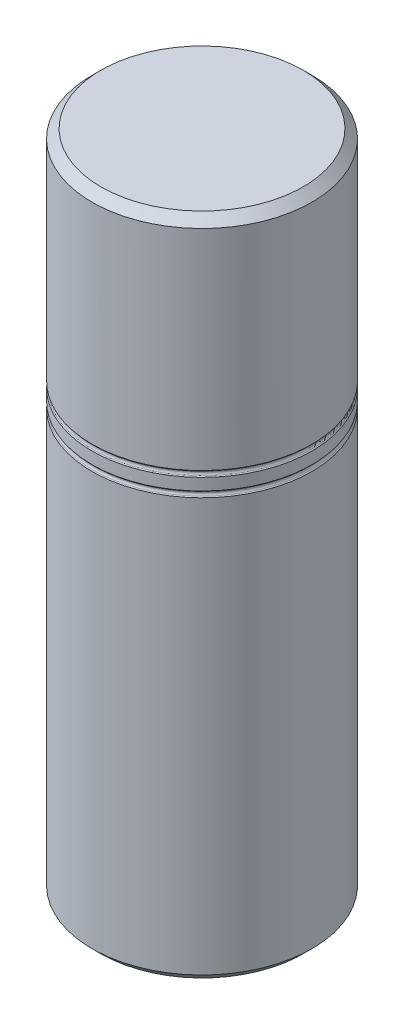
ISO-10303-21;
HEADER;
FILE_DESCRIPTION(('STEP AP214'),'2;1');
FILE_NAME('part.step','',(''),(''),'','','');
FILE_SCHEMA(('AUTOMOTIVE_DESIGN { 1 0 10303 214 1 1 1 1 }'));
ENDSEC;
DATA;
#1=APPLICATION_CONTEXT('core data for automotive mechanical design processes');
#2=APPLICATION_PROTOCOL_DEFINITION('international standard','automotive_design',2000,#1);
#3=PRODUCT_CONTEXT('',#1,'mechanical');
#4=PRODUCT('Part','Part','',(#3));
#5=PRODUCT_RELATED_PRODUCT_CATEGORY('part','',(#4));
#6=PRODUCT_DEFINITION_FORMATION('','',#4);
#7=PRODUCT_DEFINITION_CONTEXT('part definition',#1,'design');
#8=PRODUCT_DEFINITION('design','',#6,#7);
#9=PRODUCT_DEFINITION_SHAPE('','',#8);
#10=(LENGTH_UNIT() NAMED_UNIT(*) SI_UNIT(.MILLI.,.METRE.));
#11=(NAMED_UNIT(*) PLANE_ANGLE_UNIT() SI_UNIT($,.RADIAN.));
#12=(NAMED_UNIT(*) SI_UNIT($,.STERADIAN.) SOLID_ANGLE_UNIT());
#13=UNCERTAINTY_MEASURE_WITH_UNIT(LENGTH_MEASURE(1.E-05),#10,'distance_accuracy_value','');
#14=(GEOMETRIC_REPRESENTATION_CONTEXT(3) GLOBAL_UNCERTAINTY_ASSIGNED_CONTEXT((#13)) GLOBAL_UNIT_ASSIGNED_CONTEXT((#10,
#11,#12)) REPRESENTATION_CONTEXT('',''));
#15=CARTESIAN_POINT('',(0.,0.,0.));
#16=DIRECTION('',(0.,0.,1.));
#17=DIRECTION('',(1.,0.,0.));
#18=AXIS2_PLACEMENT_3D('',#15,#16,#17);
#19=CARTESIAN_POINT('',(0.,0.,0.));
#20=DIRECTION('',(0.,-1.,0.));
#21=DIRECTION('',(0.,0.,-1.));
#22=AXIS2_PLACEMENT_3D('',#19,#20,#21);
#23=CYLINDRICAL_SURFACE('',#22,9.4615);
#24=CARTESIAN_POINT('',(0.,37.846,0.));
#25=DIRECTION('',(0.,-1.,0.));
#26=DIRECTION('',(0.,0.,-1.));
#27=AXIS2_PLACEMENT_3D('',#24,#25,#26);
#28=CIRCLE('',#27,9.4615);
#29=CARTESIAN_POINT('',(0.,37.846,-9.4615));
#30=VERTEX_POINT('',#29);
#31=EDGE_CURVE('E36',#30,#30,#28,.F.);
#32=ORIENTED_EDGE('',*,*,#31,.F.);
#33=EDGE_LOOP('',(#32));
#34=FACE_BOUND('',#33,.T.);
#35=CARTESIAN_POINT('',(0.,36.83,0.));
#36=DIRECTION('',(0.,1.,0.));
#37=DIRECTION('',(0.,0.,1.));
#38=AXIS2_PLACEMENT_3D('',#35,#36,#37);
#39=CIRCLE('',#38,9.4615);
#40=CARTESIAN_POINT('',(0.,36.83,9.4615));
#41=VERTEX_POINT('',#40);
#42=EDGE_CURVE('E49',#41,#41,#39,.F.);
#43=ORIENTED_EDGE('',*,*,#42,.F.);
#44=EDGE_LOOP('',(#43));
#45=FACE_BOUND('',#44,.T.);
#46=ADVANCED_FACE('F32',(#34,#45),#23,.T.);
#47=CARTESIAN_POINT('',(0.,36.322,0.));
#48=DIRECTION('',(0.,-1.,0.));
#49=DIRECTION('',(0.,0.,-1.));
#50=AXIS2_PLACEMENT_3D('',#47,#48,#49);
#51=CIRCLE('',#50,9.4615);
#52=CARTESIAN_POINT('',(0.,36.322,-9.4615));
#53=VERTEX_POINT('',#52);
#54=EDGE_CURVE('E52',#53,#53,#51,.F.);
#55=ORIENTED_EDGE('',*,*,#54,.F.);
#56=EDGE_LOOP('',(#55));
#57=FACE_BOUND('',#56,.T.);
#58=CARTESIAN_POINT('',(0.,0.762,0.));
#59=DIRECTION('',(0.,-1.,0.));
#60=DIRECTION('',(0.,0.,-1.));
#61=AXIS2_PLACEMENT_3D('',#58,#59,#60);
#62=CIRCLE('',#61,9.4615);
#63=CARTESIAN_POINT('',(0.,0.762,-9.4615));
#64=VERTEX_POINT('',#63);
#65=EDGE_CURVE('E45',#64,#64,#62,.T.);
#66=ORIENTED_EDGE('',*,*,#65,.F.);
#67=EDGE_LOOP('',(#66));
#68=FACE_BOUND('',#67,.T.);
#69=ADVANCED_FACE('F91',(#57,#68),#23,.T.);
#70=CARTESIAN_POINT('',(0.,0.,0.));
#71=DIRECTION('',(0.,-1.,0.));
#72=DIRECTION('',(0.,0.,-1.));
#73=AXIS2_PLACEMENT_3D('',#70,#71,#72);
#74=CYLINDRICAL_SURFACE('',#73,4.8006);
#75=CARTESIAN_POINT('',(0.,0.,0.));
#76=DIRECTION('',(0.,-1.,0.));
#77=DIRECTION('',(0.,0.,-1.));
#78=AXIS2_PLACEMENT_3D('',#75,#76,#77);
#79=CIRCLE('',#78,4.8006);
#80=CARTESIAN_POINT('',(0.,0.,-4.8006));
#81=VERTEX_POINT('',#80);
#82=EDGE_CURVE('E10',#81,#81,#79,.T.);
#83=ORIENTED_EDGE('',*,*,#82,.T.);
#84=EDGE_LOOP('',(#83));
#85=FACE_BOUND('',#84,.T.);
#86=CARTESIAN_POINT('',(0.,2.032,0.));
#87=DIRECTION('',(0.,-1.,0.));
#88=DIRECTION('',(0.,0.,-1.));
#89=AXIS2_PLACEMENT_3D('',#86,#87,#88);
#90=CIRCLE('',#89,4.8006);
#91=CARTESIAN_POINT('',(0.,2.032,-4.8006));
#92=VERTEX_POINT('',#91);
#93=EDGE_CURVE('E55',#92,#92,#90,.T.);
#94=ORIENTED_EDGE('',*,*,#93,.F.);
#95=EDGE_LOOP('',(#94));
#96=FACE_BOUND('',#95,.T.);
#97=ADVANCED_FACE('F34',(#85,#96),#74,.F.);
#98=CARTESIAN_POINT('',(8.6995,0.,0.));
#99=DIRECTION('',(0.,-1.,0.));
#100=DIRECTION('',(0.,0.,-1.));
#101=AXIS2_PLACEMENT_3D('',#98,#99,#100);
#102=PLANE('',#101);
#103=CARTESIAN_POINT('',(0.,0.,0.));
#104=DIRECTION('',(0.,-1.,0.));
#105=DIRECTION('',(0.,0.,-1.));
#106=AXIS2_PLACEMENT_3D('',#103,#104,#105);
#107=CIRCLE('',#106,8.6995);
#108=CARTESIAN_POINT('',(0.,0.,-8.6995));
#109=VERTEX_POINT('',#108);
#110=EDGE_CURVE('E40',#109,#109,#107,.T.);
#111=ORIENTED_EDGE('',*,*,#110,.T.);
#112=EDGE_LOOP('',(#111));
#113=FACE_BOUND('',#112,.T.);
#114=ORIENTED_EDGE('',*,*,#82,.F.);
#115=EDGE_LOOP('',(#114));
#116=FACE_BOUND('',#115,.T.);
#117=ADVANCED_FACE('F100',(#113,#116),#102,.T.);
#118=CARTESIAN_POINT('',(0.,0.,0.));
#119=DIRECTION('',(0.,1.,0.));
#120=DIRECTION('',(0.,0.,1.));
#121=AXIS2_PLACEMENT_3D('',#118,#119,#120);
#122=CONICAL_SURFACE('',#121,8.6995,0.785398163397449);
#123=ORIENTED_EDGE('',*,*,#65,.T.);
#124=EDGE_LOOP('',(#123));
#125=FACE_BOUND('',#124,.T.);
#126=ORIENTED_EDGE('',*,*,#110,.F.);
#127=EDGE_LOOP('',(#126));
#128=FACE_BOUND('',#127,.T.);
#129=ADVANCED_FACE('F88',(#125,#128),#122,.T.);
#130=CARTESIAN_POINT('',(4.5466,2.286,0.));
#131=DIRECTION('',(0.,-1.,0.));
#132=DIRECTION('',(0.,0.,-1.));
#133=AXIS2_PLACEMENT_3D('',#130,#131,#132);
#134=PLANE('',#133);
#135=CARTESIAN_POINT('',(0.,2.286,0.));
#136=DIRECTION('',(0.,-1.,0.));
#137=DIRECTION('',(0.,0.,-1.));
#138=AXIS2_PLACEMENT_3D('',#135,#136,#137);
#139=CIRCLE('',#138,4.5466);
#140=CARTESIAN_POINT('',(0.,2.286,-4.5466));
#141=VERTEX_POINT('',#140);
#142=EDGE_CURVE('E77',#141,#141,#139,.T.);
#143=ORIENTED_EDGE('',*,*,#142,.T.);
#144=EDGE_LOOP('',(#143));
#145=FACE_BOUND('',#144,.T.);
#146=ADVANCED_FACE('F123',(#145),#134,.T.);
#147=CARTESIAN_POINT('',(0.,2.286,0.));
#148=DIRECTION('',(0.,-1.,0.));
#149=DIRECTION('',(0.,0.,-1.));
#150=AXIS2_PLACEMENT_3D('',#147,#148,#149);
#151=CONICAL_SURFACE('',#150,4.5466,0.785398163397448);
#152=ORIENTED_EDGE('',*,*,#93,.T.);
#153=EDGE_LOOP('',(#152));
#154=FACE_BOUND('',#153,.T.);
#155=ORIENTED_EDGE('',*,*,#142,.F.);
#156=EDGE_LOOP('',(#155));
#157=FACE_BOUND('',#156,.T.);
#158=ADVANCED_FACE('F126',(#154,#157),#151,.F.);
#159=CARTESIAN_POINT('',(0.,36.3963948775786,0.));
#160=DIRECTION('',(0.,-1.,0.));
#161=DIRECTION('',(0.,0.,-1.));
#162=AXIS2_PLACEMENT_3D('',#159,#160,#161);
#163=CONICAL_SURFACE('',#162,9.38710512242139,0.785398163397448);
#164=ORIENTED_EDGE('',*,*,#54,.T.);
#165=EDGE_LOOP('',(#164));
#166=FACE_BOUND('',#165,.T.);
#167=CARTESIAN_POINT('',(0.,36.3963948775786,0.));
#168=DIRECTION('',(0.,-1.,0.));
#169=DIRECTION('',(0.,0.,-1.));
#170=AXIS2_PLACEMENT_3D('',#167,#168,#169);
#171=CIRCLE('',#170,9.38710512242139);
#172=CARTESIAN_POINT('',(0.,36.3963948775786,-9.38710512242139));
#173=VERTEX_POINT('',#172);
#174=EDGE_CURVE('E62',#173,#173,#171,.T.);
#175=ORIENTED_EDGE('',*,*,#174,.T.);
#176=EDGE_LOOP('',(#175));
#177=FACE_BOUND('',#176,.T.);
#178=ADVANCED_FACE('F130',(#166,#177),#163,.T.);
#179=CARTESIAN_POINT('',(0.,36.8935,0.));
#180=DIRECTION('',(0.,1.,0.));
#181=DIRECTION('',(0.,0.,1.));
#182=AXIS2_PLACEMENT_3D('',#179,#180,#181);
#183=CONICAL_SURFACE('',#182,9.525,0.785398163397448);
#184=ORIENTED_EDGE('',*,*,#42,.T.);
#185=EDGE_LOOP('',(#184));
#186=FACE_BOUND('',#185,.T.);
#187=CARTESIAN_POINT('',(0.,36.7556051224214,0.));
#188=DIRECTION('',(0.,-1.,0.));
#189=DIRECTION('',(0.,0.,-1.));
#190=AXIS2_PLACEMENT_3D('',#187,#188,#189);
#191=CIRCLE('',#190,9.38710512242139);
#192=CARTESIAN_POINT('',(0.,36.7556051224214,-9.38710512242139));
#193=VERTEX_POINT('',#192);
#194=EDGE_CURVE('E53',#193,#193,#191,.T.);
#195=ORIENTED_EDGE('',*,*,#194,.F.);
#196=EDGE_LOOP('',(#195));
#197=FACE_BOUND('',#196,.T.);
#198=ADVANCED_FACE('F134',(#186,#197),#183,.T.);
#199=CARTESIAN_POINT('',(0.,36.576,0.));
#200=DIRECTION('',(0.,-1.,0.));
#201=DIRECTION('',(0.,0.,-1.));
#202=AXIS2_PLACEMENT_3D('',#199,#200,#201);
#203=TOROIDAL_SURFACE('',#202,9.56671024484277,0.254000000000003);
#204=ORIENTED_EDGE('',*,*,#174,.F.);
#205=EDGE_LOOP('',(#204));
#206=FACE_BOUND('',#205,.T.);
#207=ORIENTED_EDGE('',*,*,#194,.T.);
#208=EDGE_LOOP('',(#207));
#209=FACE_BOUND('',#208,.T.);
#210=ADVANCED_FACE('F138',(#206,#209),#203,.F.);
#211=CARTESIAN_POINT('',(0.,37.9203948775786,0.));
#212=DIRECTION('',(0.,-1.,0.));
#213=DIRECTION('',(0.,0.,-1.));
#214=AXIS2_PLACEMENT_3D('',#211,#212,#213);
#215=CONICAL_SURFACE('',#214,9.38710512242139,0.785398163397448);
#216=ORIENTED_EDGE('',*,*,#31,.T.);
#217=EDGE_LOOP('',(#216));
#218=FACE_BOUND('',#217,.T.);
#219=CARTESIAN_POINT('',(0.,37.9203948775786,0.));
#220=DIRECTION('',(0.,-1.,0.));
#221=DIRECTION('',(0.,0.,-1.));
#222=AXIS2_PLACEMENT_3D('',#219,#220,#221);
#223=CIRCLE('',#222,9.38710512242139);
#224=CARTESIAN_POINT('',(0.,37.9203948775786,-9.38710512242139));
#225=VERTEX_POINT('',#224);
#226=EDGE_CURVE('E64',#225,#225,#223,.T.);
#227=ORIENTED_EDGE('',*,*,#226,.T.);
#228=EDGE_LOOP('',(#227));
#229=FACE_BOUND('',#228,.T.);
#230=ADVANCED_FACE('F142',(#218,#229),#215,.T.);
#231=CARTESIAN_POINT('',(0.,38.4175,0.));
#232=DIRECTION('',(0.,1.,0.));
#233=DIRECTION('',(0.,0.,1.));
#234=AXIS2_PLACEMENT_3D('',#231,#232,#233);
#235=CONICAL_SURFACE('',#234,9.525,0.785398163397448);
#236=CARTESIAN_POINT('',(0.,38.354,0.));
#237=DIRECTION('',(0.,1.,0.));
#238=DIRECTION('',(0.,0.,1.));
#239=AXIS2_PLACEMENT_3D('',#236,#237,#238);
#240=CIRCLE('',#239,9.4615);
#241=CARTESIAN_POINT('',(0.,38.354,9.4615));
#242=VERTEX_POINT('',#241);
#243=EDGE_CURVE('E56',#242,#242,#240,.F.);
#244=ORIENTED_EDGE('',*,*,#243,.T.);
#245=EDGE_LOOP('',(#244));
#246=FACE_BOUND('',#245,.T.);
#247=CARTESIAN_POINT('',(0.,38.2796051224214,0.));
#248=DIRECTION('',(0.,-1.,0.));
#249=DIRECTION('',(0.,0.,-1.));
#250=AXIS2_PLACEMENT_3D('',#247,#248,#249);
#251=CIRCLE('',#250,9.38710512242139);
#252=CARTESIAN_POINT('',(0.,38.2796051224214,-9.38710512242139));
#253=VERTEX_POINT('',#252);
#254=EDGE_CURVE('E58',#253,#253,#251,.T.);
#255=ORIENTED_EDGE('',*,*,#254,.F.);
#256=EDGE_LOOP('',(#255));
#257=FACE_BOUND('',#256,.T.);
#258=ADVANCED_FACE('F146',(#246,#257),#235,.T.);
#259=CARTESIAN_POINT('',(0.,38.1,0.));
#260=DIRECTION('',(0.,-1.,0.));
#261=DIRECTION('',(0.,0.,-1.));
#262=AXIS2_PLACEMENT_3D('',#259,#260,#261);
#263=TOROIDAL_SURFACE('',#262,9.56671024484277,0.254000000000003);
#264=ORIENTED_EDGE('',*,*,#226,.F.);
#265=EDGE_LOOP('',(#264));
#266=FACE_BOUND('',#265,.T.);
#267=ORIENTED_EDGE('',*,*,#254,.T.);
#268=EDGE_LOOP('',(#267));
#269=FACE_BOUND('',#268,.T.);
#270=ADVANCED_FACE('F119',(#266,#269),#263,.F.);
#271=CARTESIAN_POINT('',(8.6995,57.15,0.));
#272=DIRECTION('',(0.,1.,0.));
#273=DIRECTION('',(0.,0.,1.));
#274=AXIS2_PLACEMENT_3D('',#271,#272,#273);
#275=PLANE('',#274);
#276=CARTESIAN_POINT('',(0.,57.15,0.));
#277=DIRECTION('',(0.,-1.,0.));
#278=DIRECTION('',(0.,0.,-1.));
#279=AXIS2_PLACEMENT_3D('',#276,#277,#278);
#280=CIRCLE('',#279,8.6995);
#281=CARTESIAN_POINT('',(0.,57.15,-8.6995));
#282=VERTEX_POINT('',#281);
#283=EDGE_CURVE('E80',#282,#282,#280,.T.);
#284=ORIENTED_EDGE('',*,*,#283,.F.);
#285=EDGE_LOOP('',(#284));
#286=FACE_BOUND('',#285,.T.);
#287=ADVANCED_FACE('F111',(#286),#275,.T.);
#288=CARTESIAN_POINT('',(0.,56.388,0.));
#289=DIRECTION('',(0.,-1.,0.));
#290=DIRECTION('',(0.,0.,-1.));
#291=AXIS2_PLACEMENT_3D('',#288,#289,#290);
#292=CONICAL_SURFACE('',#291,9.4615,0.78539816339745);
#293=ORIENTED_EDGE('',*,*,#283,.T.);
#294=EDGE_LOOP('',(#293));
#295=FACE_BOUND('',#294,.T.);
#296=CARTESIAN_POINT('',(0.,56.388,0.));
#297=DIRECTION('',(0.,-1.,0.));
#298=DIRECTION('',(0.,0.,-1.));
#299=AXIS2_PLACEMENT_3D('',#296,#297,#298);
#300=CIRCLE('',#299,9.4615);
#301=CARTESIAN_POINT('',(0.,56.388,-9.4615));
#302=VERTEX_POINT('',#301);
#303=EDGE_CURVE('E83',#302,#302,#300,.T.);
#304=ORIENTED_EDGE('',*,*,#303,.F.);
#305=EDGE_LOOP('',(#304));
#306=FACE_BOUND('',#305,.T.);
#307=ADVANCED_FACE('F106',(#295,#306),#292,.T.);
#308=ORIENTED_EDGE('',*,*,#243,.F.);
#309=EDGE_LOOP('',(#308));
#310=FACE_BOUND('',#309,.T.);
#311=ORIENTED_EDGE('',*,*,#303,.T.);
#312=EDGE_LOOP('',(#311));
#313=FACE_BOUND('',#312,.T.);
#314=ADVANCED_FACE('F95',(#310,#313),#23,.T.);
#315=CLOSED_SHELL('',(#46,#69,#97,#117,#129,#146,#158,#178,#198,#210,#230,#258,#270,#287,#307,#314));
#316=MANIFOLD_SOLID_BREP('B2',#315);
#317=ADVANCED_BREP_SHAPE_REPRESENTATION('',(#18,#316),#14);
#318=SHAPE_DEFINITION_REPRESENTATION(#9,#317);
ENDSEC;
END-ISO-10303-21;
